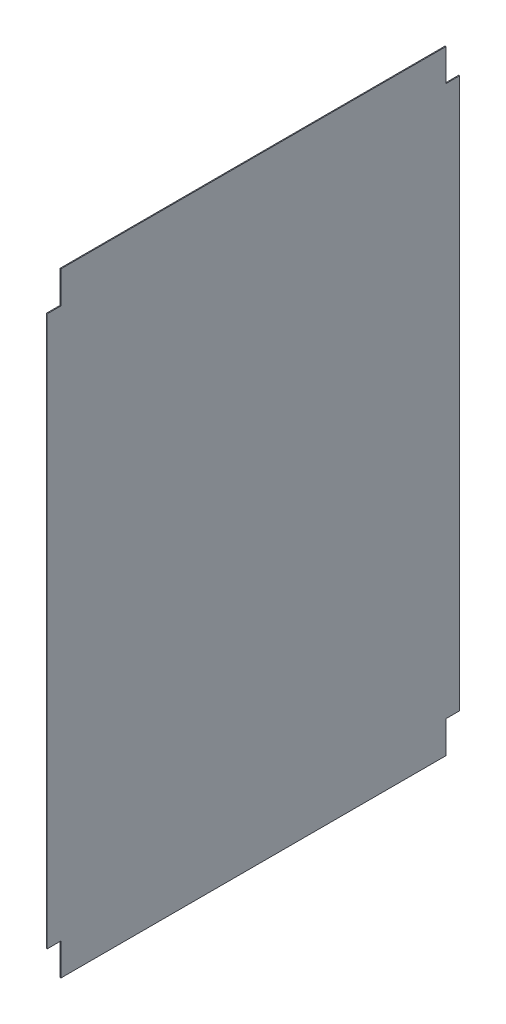
ISO-10303-21;
HEADER;
FILE_DESCRIPTION(('STEP AP214'),'2;1');
FILE_NAME('part.step','',(''),(''),'','','');
FILE_SCHEMA(('AUTOMOTIVE_DESIGN { 1 0 10303 214 1 1 1 1 }'));
ENDSEC;
DATA;
#1=APPLICATION_CONTEXT('core data for automotive mechanical design processes');
#2=APPLICATION_PROTOCOL_DEFINITION('international standard','automotive_design',2000,#1);
#3=PRODUCT_CONTEXT('',#1,'mechanical');
#4=PRODUCT('Part','Part','',(#3));
#5=PRODUCT_RELATED_PRODUCT_CATEGORY('part','',(#4));
#6=PRODUCT_DEFINITION_FORMATION('','',#4);
#7=PRODUCT_DEFINITION_CONTEXT('part definition',#1,'design');
#8=PRODUCT_DEFINITION('design','',#6,#7);
#9=PRODUCT_DEFINITION_SHAPE('','',#8);
#10=(LENGTH_UNIT() NAMED_UNIT(*) SI_UNIT(.MILLI.,.METRE.));
#11=(NAMED_UNIT(*) PLANE_ANGLE_UNIT() SI_UNIT($,.RADIAN.));
#12=(NAMED_UNIT(*) SI_UNIT($,.STERADIAN.) SOLID_ANGLE_UNIT());
#13=UNCERTAINTY_MEASURE_WITH_UNIT(LENGTH_MEASURE(1.E-05),#10,'distance_accuracy_value','');
#14=(GEOMETRIC_REPRESENTATION_CONTEXT(3) GLOBAL_UNCERTAINTY_ASSIGNED_CONTEXT((#13)) GLOBAL_UNIT_ASSIGNED_CONTEXT((#10,
#11,#12)) REPRESENTATION_CONTEXT('',''));
#15=CARTESIAN_POINT('',(0.,0.,0.));
#16=DIRECTION('',(0.,0.,1.));
#17=DIRECTION('',(1.,0.,0.));
#18=AXIS2_PLACEMENT_3D('',#15,#16,#17);
#19=CARTESIAN_POINT('',(0.1,18.1484257871064,20.9820089955023));
#20=DIRECTION('',(0.,0.,-1.));
#21=DIRECTION('',(0.,1.,0.));
#22=AXIS2_PLACEMENT_3D('',#19,#20,#21);
#23=PLANE('',#22);
#24=DIRECTION('',(0.,-1.,0.));
#25=VECTOR('',#24,1.);
#26=CARTESIAN_POINT('',(0.,18.1484257871064,20.9820089955023));
#27=LINE('',#26,#25);
#28=CARTESIAN_POINT('',(0.,14.6484257871064,20.9820089955023));
#29=VERTEX_POINT('',#28);
#30=CARTESIAN_POINT('',(0.,-45.3515742128936,20.9820089955022));
#31=VERTEX_POINT('',#30);
#32=EDGE_CURVE('E164',#29,#31,#27,.T.);
#33=ORIENTED_EDGE('',*,*,#32,.T.);
#34=DIRECTION('',(1.,0.,0.));
#35=VECTOR('',#34,1.);
#36=CARTESIAN_POINT('',(0.,-45.3515742128936,20.9820089955022));
#37=LINE('',#36,#35);
#38=CARTESIAN_POINT('',(0.1,-45.3515742128936,20.9820089955022));
#39=VERTEX_POINT('',#38);
#40=EDGE_CURVE('E211',#31,#39,#37,.T.);
#41=ORIENTED_EDGE('',*,*,#40,.T.);
#42=DIRECTION('',(0.,-1.,0.));
#43=VECTOR('',#42,1.);
#44=CARTESIAN_POINT('',(0.1,18.1484257871064,20.9820089955023));
#45=LINE('',#44,#43);
#46=CARTESIAN_POINT('',(0.1,14.6484257871064,20.9820089955023));
#47=VERTEX_POINT('',#46);
#48=EDGE_CURVE('E162',#47,#39,#45,.T.);
#49=ORIENTED_EDGE('',*,*,#48,.F.);
#50=DIRECTION('',(1.,0.,0.));
#51=VECTOR('',#50,1.);
#52=CARTESIAN_POINT('',(0.,14.6484257871064,20.9820089955023));
#53=LINE('',#52,#51);
#54=EDGE_CURVE('E180',#29,#47,#53,.T.);
#55=ORIENTED_EDGE('',*,*,#54,.F.);
#56=EDGE_LOOP('',(#33,#41,#49,#55));
#57=FACE_BOUND('',#56,.T.);
#58=ADVANCED_FACE('F41',(#57),#23,.F.);
#59=CARTESIAN_POINT('',(0.1,-48.8515742128936,20.9820089955022));
#60=DIRECTION('',(0.,1.,0.));
#61=DIRECTION('',(0.,0.,1.));
#62=AXIS2_PLACEMENT_3D('',#59,#60,#61);
#63=PLANE('',#62);
#64=DIRECTION('',(0.,0.,-1.));
#65=VECTOR('',#64,1.);
#66=CARTESIAN_POINT('',(0.1,-48.8515742128936,20.9820089955022));
#67=LINE('',#66,#65);
#68=CARTESIAN_POINT('',(0.1,-48.8515742128936,19.4820089955022));
#69=VERTEX_POINT('',#68);
#70=CARTESIAN_POINT('',(0.1,-48.8515742128936,-22.5179910044978));
#71=VERTEX_POINT('',#70);
#72=EDGE_CURVE('E173',#69,#71,#67,.T.);
#73=ORIENTED_EDGE('',*,*,#72,.F.);
#74=DIRECTION('',(1.,0.,0.));
#75=VECTOR('',#74,1.);
#76=CARTESIAN_POINT('',(0.,-48.8515742128936,19.4820089955022));
#77=LINE('',#76,#75);
#78=CARTESIAN_POINT('',(0.,-48.8515742128936,19.4820089955022));
#79=VERTEX_POINT('',#78);
#80=EDGE_CURVE('E205',#79,#69,#77,.T.);
#81=ORIENTED_EDGE('',*,*,#80,.F.);
#82=DIRECTION('',(0.,0.,-1.));
#83=VECTOR('',#82,1.);
#84=CARTESIAN_POINT('',(0.,-48.8515742128936,20.9820089955022));
#85=LINE('',#84,#83);
#86=CARTESIAN_POINT('',(0.,-48.8515742128936,-22.5179910044978));
#87=VERTEX_POINT('',#86);
#88=EDGE_CURVE('E158',#79,#87,#85,.T.);
#89=ORIENTED_EDGE('',*,*,#88,.T.);
#90=DIRECTION('',(1.,0.,0.));
#91=VECTOR('',#90,1.);
#92=CARTESIAN_POINT('',(0.,-48.8515742128936,-22.5179910044978));
#93=LINE('',#92,#91);
#94=EDGE_CURVE('E224',#87,#71,#93,.T.);
#95=ORIENTED_EDGE('',*,*,#94,.T.);
#96=EDGE_LOOP('',(#73,#81,#89,#95));
#97=FACE_BOUND('',#96,.T.);
#98=ADVANCED_FACE('F265',(#97),#63,.F.);
#99=CARTESIAN_POINT('',(0.1,18.1484257871064,-24.0179910044977));
#100=DIRECTION('',(0.,0.,1.));
#101=DIRECTION('',(0.,-1.,0.));
#102=AXIS2_PLACEMENT_3D('',#99,#100,#101);
#103=PLANE('',#102);
#104=DIRECTION('',(0.,1.,0.));
#105=VECTOR('',#104,1.);
#106=CARTESIAN_POINT('',(0.,18.1484257871064,-24.0179910044977));
#107=LINE('',#106,#105);
#108=CARTESIAN_POINT('',(0.,-45.3515742128936,-24.0179910044978));
#109=VERTEX_POINT('',#108);
#110=CARTESIAN_POINT('',(0.,14.6484257871064,-24.0179910044977));
#111=VERTEX_POINT('',#110);
#112=EDGE_CURVE('E151',#109,#111,#107,.T.);
#113=ORIENTED_EDGE('',*,*,#112,.T.);
#114=DIRECTION('',(1.,0.,0.));
#115=VECTOR('',#114,1.);
#116=CARTESIAN_POINT('',(0.,14.6484257871064,-24.0179910044977));
#117=LINE('',#116,#115);
#118=CARTESIAN_POINT('',(0.1,14.6484257871064,-24.0179910044977));
#119=VERTEX_POINT('',#118);
#120=EDGE_CURVE('E198',#111,#119,#117,.T.);
#121=ORIENTED_EDGE('',*,*,#120,.T.);
#122=DIRECTION('',(0.,1.,0.));
#123=VECTOR('',#122,1.);
#124=CARTESIAN_POINT('',(0.1,18.1484257871064,-24.0179910044977));
#125=LINE('',#124,#123);
#126=CARTESIAN_POINT('',(0.1,-45.3515742128936,-24.0179910044978));
#127=VERTEX_POINT('',#126);
#128=EDGE_CURVE('E50',#127,#119,#125,.T.);
#129=ORIENTED_EDGE('',*,*,#128,.F.);
#130=DIRECTION('',(1.,0.,0.));
#131=VECTOR('',#130,1.);
#132=CARTESIAN_POINT('',(0.,-45.3515742128936,-24.0179910044978));
#133=LINE('',#132,#131);
#134=EDGE_CURVE('E136',#109,#127,#133,.T.);
#135=ORIENTED_EDGE('',*,*,#134,.F.);
#136=EDGE_LOOP('',(#113,#121,#129,#135));
#137=FACE_BOUND('',#136,.T.);
#138=ADVANCED_FACE('F149',(#137),#103,.F.);
#139=CARTESIAN_POINT('',(0.1,18.1484257871064,20.9820089955023));
#140=DIRECTION('',(0.,-1.,0.));
#141=DIRECTION('',(0.,0.,-1.));
#142=AXIS2_PLACEMENT_3D('',#139,#140,#141);
#143=PLANE('',#142);
#144=DIRECTION('',(0.,0.,1.));
#145=VECTOR('',#144,1.);
#146=CARTESIAN_POINT('',(0.1,18.1484257871064,20.9820089955023));
#147=LINE('',#146,#145);
#148=CARTESIAN_POINT('',(0.1,18.1484257871064,-22.5179910044977));
#149=VERTEX_POINT('',#148);
#150=CARTESIAN_POINT('',(0.1,18.1484257871064,19.4820089955023));
#151=VERTEX_POINT('',#150);
#152=EDGE_CURVE('E11',#149,#151,#147,.T.);
#153=ORIENTED_EDGE('',*,*,#152,.F.);
#154=DIRECTION('',(1.,0.,0.));
#155=VECTOR('',#154,1.);
#156=CARTESIAN_POINT('',(0.,18.1484257871064,-22.5179910044977));
#157=LINE('',#156,#155);
#158=CARTESIAN_POINT('',(0.,18.1484257871064,-22.5179910044977));
#159=VERTEX_POINT('',#158);
#160=EDGE_CURVE('E230',#159,#149,#157,.T.);
#161=ORIENTED_EDGE('',*,*,#160,.F.);
#162=DIRECTION('',(0.,0.,1.));
#163=VECTOR('',#162,1.);
#164=CARTESIAN_POINT('',(0.,18.1484257871064,20.9820089955023));
#165=LINE('',#164,#163);
#166=CARTESIAN_POINT('',(0.,18.1484257871064,19.4820089955023));
#167=VERTEX_POINT('',#166);
#168=EDGE_CURVE('E44',#159,#167,#165,.T.);
#169=ORIENTED_EDGE('',*,*,#168,.T.);
#170=DIRECTION('',(1.,0.,0.));
#171=VECTOR('',#170,1.);
#172=CARTESIAN_POINT('',(0.,18.1484257871064,19.4820089955023));
#173=LINE('',#172,#171);
#174=EDGE_CURVE('E169',#167,#151,#173,.T.);
#175=ORIENTED_EDGE('',*,*,#174,.T.);
#176=EDGE_LOOP('',(#153,#161,#169,#175));
#177=FACE_BOUND('',#176,.T.);
#178=ADVANCED_FACE('F289',(#177),#143,.F.);
#179=CARTESIAN_POINT('',(0.1,0.,0.));
#180=DIRECTION('',(1.,0.,0.));
#181=DIRECTION('',(0.,0.,-1.));
#182=AXIS2_PLACEMENT_3D('',#179,#180,#181);
#183=PLANE('',#182);
#184=DIRECTION('',(0.,0.,-1.));
#185=VECTOR('',#184,1.);
#186=CARTESIAN_POINT('',(0.1,14.6484257871064,-24.0179910044977));
#187=LINE('',#186,#185);
#188=CARTESIAN_POINT('',(0.1,14.6484257871064,-22.5179910044977));
#189=VERTEX_POINT('',#188);
#190=EDGE_CURVE('E238',#189,#119,#187,.T.);
#191=ORIENTED_EDGE('',*,*,#190,.F.);
#192=DIRECTION('',(0.,-1.,0.));
#193=VECTOR('',#192,1.);
#194=CARTESIAN_POINT('',(0.1,18.1484257871064,-22.5179910044977));
#195=LINE('',#194,#193);
#196=EDGE_CURVE('E215',#149,#189,#195,.T.);
#197=ORIENTED_EDGE('',*,*,#196,.F.);
#198=ORIENTED_EDGE('',*,*,#152,.T.);
#199=DIRECTION('',(0.,1.,0.));
#200=VECTOR('',#199,1.);
#201=CARTESIAN_POINT('',(0.1,18.1484257871064,19.4820089955023));
#202=LINE('',#201,#200);
#203=CARTESIAN_POINT('',(0.1,14.6484257871064,19.4820089955023));
#204=VERTEX_POINT('',#203);
#205=EDGE_CURVE('E190',#204,#151,#202,.T.);
#206=ORIENTED_EDGE('',*,*,#205,.F.);
#207=DIRECTION('',(0.,0.,-1.));
#208=VECTOR('',#207,1.);
#209=CARTESIAN_POINT('',(0.1,14.6484257871064,20.9820089955023));
#210=LINE('',#209,#208);
#211=EDGE_CURVE('E194',#47,#204,#210,.T.);
#212=ORIENTED_EDGE('',*,*,#211,.F.);
#213=ORIENTED_EDGE('',*,*,#48,.T.);
#214=DIRECTION('',(0.,0.,1.));
#215=VECTOR('',#214,1.);
#216=CARTESIAN_POINT('',(0.1,-45.3515742128936,20.9820089955022));
#217=LINE('',#216,#215);
#218=CARTESIAN_POINT('',(0.1,-45.3515742128936,19.4820089955022));
#219=VERTEX_POINT('',#218);
#220=EDGE_CURVE('E216',#219,#39,#217,.T.);
#221=ORIENTED_EDGE('',*,*,#220,.F.);
#222=DIRECTION('',(0.,1.,0.));
#223=VECTOR('',#222,1.);
#224=CARTESIAN_POINT('',(0.1,-48.8515742128936,19.4820089955022));
#225=LINE('',#224,#223);
#226=EDGE_CURVE('E220',#69,#219,#225,.T.);
#227=ORIENTED_EDGE('',*,*,#226,.F.);
#228=ORIENTED_EDGE('',*,*,#72,.T.);
#229=DIRECTION('',(0.,-1.,0.));
#230=VECTOR('',#229,1.);
#231=CARTESIAN_POINT('',(0.1,-48.8515742128936,-22.5179910044978));
#232=LINE('',#231,#230);
#233=CARTESIAN_POINT('',(0.1,-45.3515742128936,-22.5179910044978));
#234=VERTEX_POINT('',#233);
#235=EDGE_CURVE('E144',#234,#71,#232,.T.);
#236=ORIENTED_EDGE('',*,*,#235,.F.);
#237=DIRECTION('',(0.,0.,1.));
#238=VECTOR('',#237,1.);
#239=CARTESIAN_POINT('',(0.1,-45.3515742128936,-24.0179910044978));
#240=LINE('',#239,#238);
#241=EDGE_CURVE('E256',#127,#234,#240,.T.);
#242=ORIENTED_EDGE('',*,*,#241,.F.);
#243=ORIENTED_EDGE('',*,*,#128,.T.);
#244=EDGE_LOOP('',(#191,#197,#198,#206,#212,#213,#221,#227,#228,#236,#242,#243));
#245=FACE_BOUND('',#244,.T.);
#246=ADVANCED_FACE('F272',(#245),#183,.T.);
#247=CARTESIAN_POINT('',(0.,0.,0.));
#248=DIRECTION('',(1.,0.,0.));
#249=DIRECTION('',(0.,0.,-1.));
#250=AXIS2_PLACEMENT_3D('',#247,#248,#249);
#251=PLANE('',#250);
#252=DIRECTION('',(0.,-1.,0.));
#253=VECTOR('',#252,1.);
#254=CARTESIAN_POINT('',(0.,18.1484257871064,-22.5179910044977));
#255=LINE('',#254,#253);
#256=CARTESIAN_POINT('',(0.,14.6484257871064,-22.5179910044977));
#257=VERTEX_POINT('',#256);
#258=EDGE_CURVE('E241',#159,#257,#255,.T.);
#259=ORIENTED_EDGE('',*,*,#258,.T.);
#260=DIRECTION('',(0.,0.,-1.));
#261=VECTOR('',#260,1.);
#262=CARTESIAN_POINT('',(0.,14.6484257871064,-24.0179910044977));
#263=LINE('',#262,#261);
#264=EDGE_CURVE('E58',#257,#111,#263,.T.);
#265=ORIENTED_EDGE('',*,*,#264,.T.);
#266=ORIENTED_EDGE('',*,*,#112,.F.);
#267=DIRECTION('',(0.,0.,1.));
#268=VECTOR('',#267,1.);
#269=CARTESIAN_POINT('',(0.,-45.3515742128936,-24.0179910044978));
#270=LINE('',#269,#268);
#271=CARTESIAN_POINT('',(0.,-45.3515742128936,-22.5179910044978));
#272=VERTEX_POINT('',#271);
#273=EDGE_CURVE('E132',#109,#272,#270,.T.);
#274=ORIENTED_EDGE('',*,*,#273,.T.);
#275=DIRECTION('',(0.,-1.,0.));
#276=VECTOR('',#275,1.);
#277=CARTESIAN_POINT('',(0.,-48.8515742128936,-22.5179910044978));
#278=LINE('',#277,#276);
#279=EDGE_CURVE('E143',#272,#87,#278,.T.);
#280=ORIENTED_EDGE('',*,*,#279,.T.);
#281=ORIENTED_EDGE('',*,*,#88,.F.);
#282=DIRECTION('',(0.,1.,0.));
#283=VECTOR('',#282,1.);
#284=CARTESIAN_POINT('',(0.,-48.8515742128936,19.4820089955022));
#285=LINE('',#284,#283);
#286=CARTESIAN_POINT('',(0.,-45.3515742128936,19.4820089955022));
#287=VERTEX_POINT('',#286);
#288=EDGE_CURVE('E219',#79,#287,#285,.T.);
#289=ORIENTED_EDGE('',*,*,#288,.T.);
#290=DIRECTION('',(0.,0.,1.));
#291=VECTOR('',#290,1.);
#292=CARTESIAN_POINT('',(0.,-45.3515742128936,20.9820089955022));
#293=LINE('',#292,#291);
#294=EDGE_CURVE('E66',#287,#31,#293,.T.);
#295=ORIENTED_EDGE('',*,*,#294,.T.);
#296=ORIENTED_EDGE('',*,*,#32,.F.);
#297=DIRECTION('',(0.,0.,-1.));
#298=VECTOR('',#297,1.);
#299=CARTESIAN_POINT('',(0.,14.6484257871064,20.9820089955023));
#300=LINE('',#299,#298);
#301=CARTESIAN_POINT('',(0.,14.6484257871064,19.4820089955023));
#302=VERTEX_POINT('',#301);
#303=EDGE_CURVE('E193',#29,#302,#300,.T.);
#304=ORIENTED_EDGE('',*,*,#303,.T.);
#305=DIRECTION('',(0.,1.,0.));
#306=VECTOR('',#305,1.);
#307=CARTESIAN_POINT('',(0.,18.1484257871064,19.4820089955023));
#308=LINE('',#307,#306);
#309=EDGE_CURVE('E184',#302,#167,#308,.T.);
#310=ORIENTED_EDGE('',*,*,#309,.T.);
#311=ORIENTED_EDGE('',*,*,#168,.F.);
#312=EDGE_LOOP('',(#259,#265,#266,#274,#280,#281,#289,#295,#296,#304,#310,#311));
#313=FACE_BOUND('',#312,.T.);
#314=ADVANCED_FACE('F156',(#313),#251,.F.);
#315=CARTESIAN_POINT('',(0.,18.1484257871064,19.4820089955023));
#316=DIRECTION('',(0.,0.,-1.));
#317=DIRECTION('',(-1.,0.,0.));
#318=AXIS2_PLACEMENT_3D('',#315,#316,#317);
#319=PLANE('',#318);
#320=ORIENTED_EDGE('',*,*,#205,.T.);
#321=ORIENTED_EDGE('',*,*,#174,.F.);
#322=ORIENTED_EDGE('',*,*,#309,.F.);
#323=DIRECTION('',(1.,0.,0.));
#324=VECTOR('',#323,1.);
#325=CARTESIAN_POINT('',(0.,14.6484257871064,19.4820089955023));
#326=LINE('',#325,#324);
#327=EDGE_CURVE('E183',#302,#204,#326,.T.);
#328=ORIENTED_EDGE('',*,*,#327,.T.);
#329=EDGE_LOOP('',(#320,#321,#322,#328));
#330=FACE_BOUND('',#329,.T.);
#331=ADVANCED_FACE('F286',(#330),#319,.F.);
#332=CARTESIAN_POINT('',(0.,14.6484257871064,20.9820089955023));
#333=DIRECTION('',(0.,-1.,0.));
#334=DIRECTION('',(0.,0.,-1.));
#335=AXIS2_PLACEMENT_3D('',#332,#333,#334);
#336=PLANE('',#335);
#337=ORIENTED_EDGE('',*,*,#211,.T.);
#338=ORIENTED_EDGE('',*,*,#327,.F.);
#339=ORIENTED_EDGE('',*,*,#303,.F.);
#340=ORIENTED_EDGE('',*,*,#54,.T.);
#341=EDGE_LOOP('',(#337,#338,#339,#340));
#342=FACE_BOUND('',#341,.T.);
#343=ADVANCED_FACE('F283',(#342),#336,.F.);
#344=CARTESIAN_POINT('',(0.,-48.8515742128936,-22.5179910044978));
#345=DIRECTION('',(0.,0.,1.));
#346=DIRECTION('',(1.,0.,0.));
#347=AXIS2_PLACEMENT_3D('',#344,#345,#346);
#348=PLANE('',#347);
#349=ORIENTED_EDGE('',*,*,#235,.T.);
#350=ORIENTED_EDGE('',*,*,#94,.F.);
#351=ORIENTED_EDGE('',*,*,#279,.F.);
#352=DIRECTION('',(1.,0.,0.));
#353=VECTOR('',#352,1.);
#354=CARTESIAN_POINT('',(0.,-45.3515742128936,-22.5179910044978));
#355=LINE('',#354,#353);
#356=EDGE_CURVE('E138',#272,#234,#355,.T.);
#357=ORIENTED_EDGE('',*,*,#356,.T.);
#358=EDGE_LOOP('',(#349,#350,#351,#357));
#359=FACE_BOUND('',#358,.T.);
#360=ADVANCED_FACE('F295',(#359),#348,.F.);
#361=CARTESIAN_POINT('',(0.,-45.3515742128936,-24.0179910044978));
#362=DIRECTION('',(0.,1.,0.));
#363=DIRECTION('',(0.,0.,1.));
#364=AXIS2_PLACEMENT_3D('',#361,#362,#363);
#365=PLANE('',#364);
#366=ORIENTED_EDGE('',*,*,#241,.T.);
#367=ORIENTED_EDGE('',*,*,#356,.F.);
#368=ORIENTED_EDGE('',*,*,#273,.F.);
#369=ORIENTED_EDGE('',*,*,#134,.T.);
#370=EDGE_LOOP('',(#366,#367,#368,#369));
#371=FACE_BOUND('',#370,.T.);
#372=ADVANCED_FACE('F135',(#371),#365,.F.);
#373=CARTESIAN_POINT('',(0.,-45.3515742128936,20.9820089955022));
#374=DIRECTION('',(0.,1.,0.));
#375=DIRECTION('',(0.,0.,1.));
#376=AXIS2_PLACEMENT_3D('',#373,#374,#375);
#377=PLANE('',#376);
#378=ORIENTED_EDGE('',*,*,#220,.T.);
#379=ORIENTED_EDGE('',*,*,#40,.F.);
#380=ORIENTED_EDGE('',*,*,#294,.F.);
#381=DIRECTION('',(1.,0.,0.));
#382=VECTOR('',#381,1.);
#383=CARTESIAN_POINT('',(0.,-45.3515742128936,19.4820089955022));
#384=LINE('',#383,#382);
#385=EDGE_CURVE('E208',#287,#219,#384,.T.);
#386=ORIENTED_EDGE('',*,*,#385,.T.);
#387=EDGE_LOOP('',(#378,#379,#380,#386));
#388=FACE_BOUND('',#387,.T.);
#389=ADVANCED_FACE('F276',(#388),#377,.F.);
#390=CARTESIAN_POINT('',(0.,-48.8515742128936,19.4820089955022));
#391=DIRECTION('',(0.,0.,-1.));
#392=DIRECTION('',(-1.,0.,0.));
#393=AXIS2_PLACEMENT_3D('',#390,#391,#392);
#394=PLANE('',#393);
#395=ORIENTED_EDGE('',*,*,#226,.T.);
#396=ORIENTED_EDGE('',*,*,#385,.F.);
#397=ORIENTED_EDGE('',*,*,#288,.F.);
#398=ORIENTED_EDGE('',*,*,#80,.T.);
#399=EDGE_LOOP('',(#395,#396,#397,#398));
#400=FACE_BOUND('',#399,.T.);
#401=ADVANCED_FACE('F268',(#400),#394,.F.);
#402=CARTESIAN_POINT('',(0.,14.6484257871064,-24.0179910044977));
#403=DIRECTION('',(0.,-1.,0.));
#404=DIRECTION('',(0.,0.,-1.));
#405=AXIS2_PLACEMENT_3D('',#402,#403,#404);
#406=PLANE('',#405);
#407=ORIENTED_EDGE('',*,*,#190,.T.);
#408=ORIENTED_EDGE('',*,*,#120,.F.);
#409=ORIENTED_EDGE('',*,*,#264,.F.);
#410=DIRECTION('',(1.,0.,0.));
#411=VECTOR('',#410,1.);
#412=CARTESIAN_POINT('',(0.,14.6484257871064,-22.5179910044977));
#413=LINE('',#412,#411);
#414=EDGE_CURVE('E233',#257,#189,#413,.T.);
#415=ORIENTED_EDGE('',*,*,#414,.T.);
#416=EDGE_LOOP('',(#407,#408,#409,#415));
#417=FACE_BOUND('',#416,.T.);
#418=ADVANCED_FACE('F294',(#417),#406,.F.);
#419=CARTESIAN_POINT('',(0.,18.1484257871064,-22.5179910044977));
#420=DIRECTION('',(0.,0.,1.));
#421=DIRECTION('',(0.,-1.,0.));
#422=AXIS2_PLACEMENT_3D('',#419,#420,#421);
#423=PLANE('',#422);
#424=ORIENTED_EDGE('',*,*,#196,.T.);
#425=ORIENTED_EDGE('',*,*,#414,.F.);
#426=ORIENTED_EDGE('',*,*,#258,.F.);
#427=ORIENTED_EDGE('',*,*,#160,.T.);
#428=EDGE_LOOP('',(#424,#425,#426,#427));
#429=FACE_BOUND('',#428,.T.);
#430=ADVANCED_FACE('F293',(#429),#423,.F.);
#431=CLOSED_SHELL('',(#58,#98,#138,#178,#246,#314,#331,#343,#360,#372,#389,#401,#418,#430));
#432=MANIFOLD_SOLID_BREP('B2',#431);
#433=ADVANCED_BREP_SHAPE_REPRESENTATION('',(#18,#432),#14);
#434=SHAPE_DEFINITION_REPRESENTATION(#9,#433);
ENDSEC;
END-ISO-10303-21;
